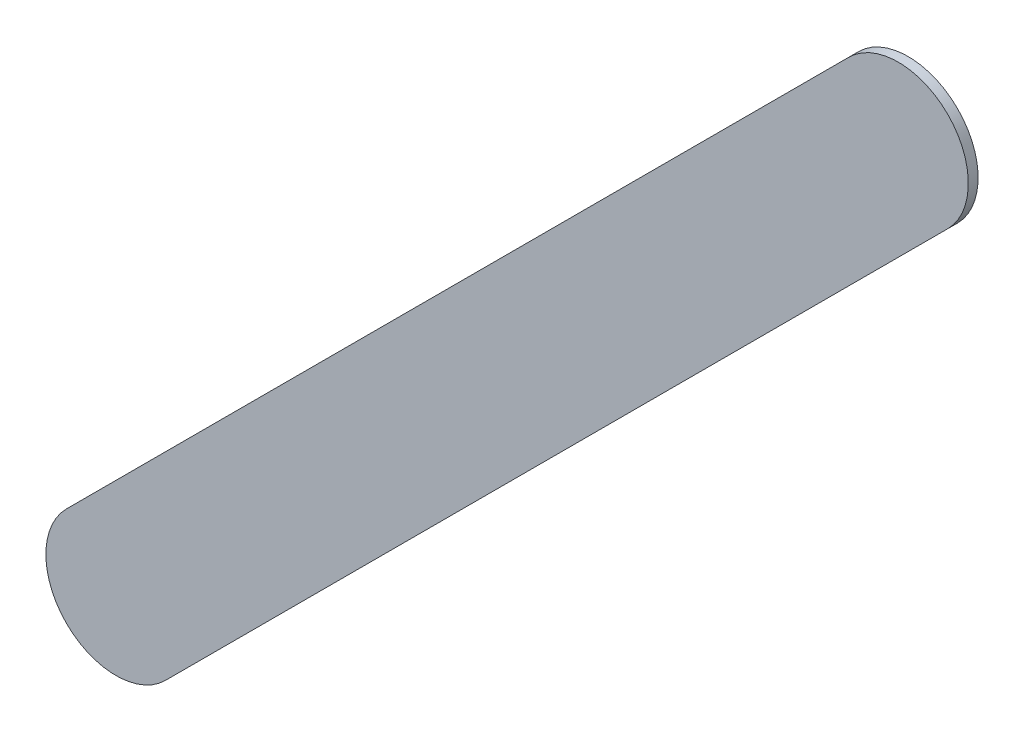
ISO-10303-21;
HEADER;
FILE_DESCRIPTION(('STEP AP214'),'2;1');
FILE_NAME('part.step','',(''),(''),'','','');
FILE_SCHEMA(('AUTOMOTIVE_DESIGN { 1 0 10303 214 1 1 1 1 }'));
ENDSEC;
DATA;
#1=APPLICATION_CONTEXT('core data for automotive mechanical design processes');
#2=APPLICATION_PROTOCOL_DEFINITION('international standard','automotive_design',2000,#1);
#3=PRODUCT_CONTEXT('',#1,'mechanical');
#4=PRODUCT('Part','Part','',(#3));
#5=PRODUCT_RELATED_PRODUCT_CATEGORY('part','',(#4));
#6=PRODUCT_DEFINITION_FORMATION('','',#4);
#7=PRODUCT_DEFINITION_CONTEXT('part definition',#1,'design');
#8=PRODUCT_DEFINITION('design','',#6,#7);
#9=PRODUCT_DEFINITION_SHAPE('','',#8);
#10=(LENGTH_UNIT() NAMED_UNIT(*) SI_UNIT(.MILLI.,.METRE.));
#11=(NAMED_UNIT(*) PLANE_ANGLE_UNIT() SI_UNIT($,.RADIAN.));
#12=(NAMED_UNIT(*) SI_UNIT($,.STERADIAN.) SOLID_ANGLE_UNIT());
#13=UNCERTAINTY_MEASURE_WITH_UNIT(LENGTH_MEASURE(1.E-05),#10,'distance_accuracy_value','');
#14=(GEOMETRIC_REPRESENTATION_CONTEXT(3) GLOBAL_UNCERTAINTY_ASSIGNED_CONTEXT((#13)) GLOBAL_UNIT_ASSIGNED_CONTEXT((#10,
#11,#12)) REPRESENTATION_CONTEXT('',''));
#15=CARTESIAN_POINT('',(0.,0.,0.));
#16=DIRECTION('',(0.,0.,1.));
#17=DIRECTION('',(1.,0.,0.));
#18=AXIS2_PLACEMENT_3D('',#15,#16,#17);
#19=CARTESIAN_POINT('',(139.622776,-108.380776,0.));
#20=DIRECTION('',(0.,0.,1.));
#21=DIRECTION('',(1.,0.,0.));
#22=AXIS2_PLACEMENT_3D('',#19,#20,#21);
#23=PLANE('',#22);
#24=DIRECTION('',(0.707106781186548,0.707106781186548,0.));
#25=VECTOR('',#24,1.);
#26=CARTESIAN_POINT('',(139.622776,-108.380776,0.));
#27=LINE('',#26,#25);
#28=CARTESIAN_POINT('',(139.622776,-108.380776,0.));
#29=VERTEX_POINT('',#28);
#30=CARTESIAN_POINT('',(142.416776,-105.586776,0.));
#31=VERTEX_POINT('',#30);
#32=EDGE_CURVE('E95',#29,#31,#27,.T.);
#33=ORIENTED_EDGE('',*,*,#32,.T.);
#34=CARTESIAN_POINT('',(142.2399995,-105.4099995,0.));
#35=DIRECTION('',(0.,0.,1.));
#36=DIRECTION('',(0.707106781186548,-0.707106781186548,0.));
#37=AXIS2_PLACEMENT_3D('',#34,#35,#36);
#38=CIRCLE('',#37,0.249999723809);
#39=CARTESIAN_POINT('',(142.063223,-105.233223,0.));
#40=VERTEX_POINT('',#39);
#41=EDGE_CURVE('E74',#31,#40,#38,.T.);
#42=ORIENTED_EDGE('',*,*,#41,.T.);
#43=DIRECTION('',(-0.707106781186548,-0.707106781186548,0.));
#44=VECTOR('',#43,1.);
#45=CARTESIAN_POINT('',(142.063223,-105.233223,0.));
#46=LINE('',#45,#44);
#47=CARTESIAN_POINT('',(139.269223,-108.027223,0.));
#48=VERTEX_POINT('',#47);
#49=EDGE_CURVE('E79',#40,#48,#46,.T.);
#50=ORIENTED_EDGE('',*,*,#49,.T.);
#51=CARTESIAN_POINT('',(139.4459995,-108.2039995,0.));
#52=DIRECTION('',(0.,0.,1.));
#53=DIRECTION('',(-0.707106781186548,0.707106781186548,0.));
#54=AXIS2_PLACEMENT_3D('',#51,#52,#53);
#55=CIRCLE('',#54,0.249999723809);
#56=EDGE_CURVE('E11',#48,#29,#55,.T.);
#57=ORIENTED_EDGE('',*,*,#56,.T.);
#58=EDGE_LOOP('',(#33,#42,#50,#57));
#59=FACE_BOUND('',#58,.T.);
#60=ADVANCED_FACE('F17',(#59),#23,.T.);
#61=CARTESIAN_POINT('',(139.622776,-108.380776,-0.035));
#62=DIRECTION('',(0.,0.,1.));
#63=DIRECTION('',(1.,0.,0.));
#64=AXIS2_PLACEMENT_3D('',#61,#62,#63);
#65=PLANE('',#64);
#66=CARTESIAN_POINT('',(139.4459995,-108.2039995,-0.035));
#67=DIRECTION('',(0.,0.,1.));
#68=DIRECTION('',(-0.707106781186548,0.707106781186548,0.));
#69=AXIS2_PLACEMENT_3D('',#66,#67,#68);
#70=CIRCLE('',#69,0.249999723809);
#71=CARTESIAN_POINT('',(139.269223,-108.027223,-0.035));
#72=VERTEX_POINT('',#71);
#73=CARTESIAN_POINT('',(139.622776,-108.380776,-0.035));
#74=VERTEX_POINT('',#73);
#75=EDGE_CURVE('E26',#72,#74,#70,.T.);
#76=ORIENTED_EDGE('',*,*,#75,.F.);
#77=DIRECTION('',(-0.707106781186548,-0.707106781186548,0.));
#78=VECTOR('',#77,1.);
#79=CARTESIAN_POINT('',(142.063223,-105.233223,-0.035));
#80=LINE('',#79,#78);
#81=CARTESIAN_POINT('',(142.063223,-105.233223,-0.035));
#82=VERTEX_POINT('',#81);
#83=EDGE_CURVE('E62',#82,#72,#80,.T.);
#84=ORIENTED_EDGE('',*,*,#83,.F.);
#85=CARTESIAN_POINT('',(142.2399995,-105.4099995,-0.035));
#86=DIRECTION('',(0.,0.,1.));
#87=DIRECTION('',(0.707106781186548,-0.707106781186548,0.));
#88=AXIS2_PLACEMENT_3D('',#85,#86,#87);
#89=CIRCLE('',#88,0.249999723809);
#90=CARTESIAN_POINT('',(142.416776,-105.586776,-0.035));
#91=VERTEX_POINT('',#90);
#92=EDGE_CURVE('E67',#91,#82,#89,.T.);
#93=ORIENTED_EDGE('',*,*,#92,.F.);
#94=DIRECTION('',(0.707106781186548,0.707106781186548,0.));
#95=VECTOR('',#94,1.);
#96=CARTESIAN_POINT('',(139.622776,-108.380776,-0.035));
#97=LINE('',#96,#95);
#98=EDGE_CURVE('E113',#74,#91,#97,.T.);
#99=ORIENTED_EDGE('',*,*,#98,.F.);
#100=EDGE_LOOP('',(#76,#84,#93,#99));
#101=FACE_BOUND('',#100,.T.);
#102=ADVANCED_FACE('F64',(#101),#65,.F.);
#103=CARTESIAN_POINT('',(139.4459995,-108.2039995,-0.035));
#104=DIRECTION('',(0.,0.,-1.));
#105=DIRECTION('',(-0.707106781186548,0.707106781186548,0.));
#106=AXIS2_PLACEMENT_3D('',#103,#104,#105);
#107=CYLINDRICAL_SURFACE('',#106,0.249999723809);
#108=ORIENTED_EDGE('',*,*,#75,.T.);
#109=DIRECTION('',(0.,0.,1.));
#110=VECTOR('',#109,1.);
#111=CARTESIAN_POINT('',(139.622776,-108.380776,-0.035));
#112=LINE('',#111,#110);
#113=EDGE_CURVE('E89',#74,#29,#112,.T.);
#114=ORIENTED_EDGE('',*,*,#113,.T.);
#115=ORIENTED_EDGE('',*,*,#56,.F.);
#116=DIRECTION('',(0.,0.,1.));
#117=VECTOR('',#116,1.);
#118=CARTESIAN_POINT('',(139.269223,-108.027223,-0.035));
#119=LINE('',#118,#117);
#120=EDGE_CURVE('E73',#72,#48,#119,.T.);
#121=ORIENTED_EDGE('',*,*,#120,.F.);
#122=EDGE_LOOP('',(#108,#114,#115,#121));
#123=FACE_BOUND('',#122,.T.);
#124=ADVANCED_FACE('F173',(#123),#107,.T.);
#125=CARTESIAN_POINT('',(142.063223,-105.233223,-0.035));
#126=DIRECTION('',(0.707106781186548,-0.707106781186548,0.));
#127=DIRECTION('',(0.,0.,-1.));
#128=AXIS2_PLACEMENT_3D('',#125,#126,#127);
#129=PLANE('',#128);
#130=ORIENTED_EDGE('',*,*,#83,.T.);
#131=ORIENTED_EDGE('',*,*,#120,.T.);
#132=ORIENTED_EDGE('',*,*,#49,.F.);
#133=DIRECTION('',(0.,0.,1.));
#134=VECTOR('',#133,1.);
#135=CARTESIAN_POINT('',(142.063223,-105.233223,-0.035));
#136=LINE('',#135,#134);
#137=EDGE_CURVE('E77',#82,#40,#136,.T.);
#138=ORIENTED_EDGE('',*,*,#137,.F.);
#139=EDGE_LOOP('',(#130,#131,#132,#138));
#140=FACE_BOUND('',#139,.T.);
#141=ADVANCED_FACE('F78',(#140),#129,.F.);
#142=CARTESIAN_POINT('',(142.2399995,-105.4099995,-0.035));
#143=DIRECTION('',(0.,0.,-1.));
#144=DIRECTION('',(0.707106781186548,-0.707106781186548,0.));
#145=AXIS2_PLACEMENT_3D('',#142,#143,#144);
#146=CYLINDRICAL_SURFACE('',#145,0.249999723809);
#147=ORIENTED_EDGE('',*,*,#92,.T.);
#148=ORIENTED_EDGE('',*,*,#137,.T.);
#149=ORIENTED_EDGE('',*,*,#41,.F.);
#150=DIRECTION('',(0.,0.,1.));
#151=VECTOR('',#150,1.);
#152=CARTESIAN_POINT('',(142.416776,-105.586776,-0.035));
#153=LINE('',#152,#151);
#154=EDGE_CURVE('E86',#91,#31,#153,.T.);
#155=ORIENTED_EDGE('',*,*,#154,.F.);
#156=EDGE_LOOP('',(#147,#148,#149,#155));
#157=FACE_BOUND('',#156,.T.);
#158=ADVANCED_FACE('F84',(#157),#146,.T.);
#159=CARTESIAN_POINT('',(139.622776,-108.380776,-0.035));
#160=DIRECTION('',(-0.707106781186548,0.707106781186548,0.));
#161=DIRECTION('',(0.,0.,1.));
#162=AXIS2_PLACEMENT_3D('',#159,#160,#161);
#163=PLANE('',#162);
#164=ORIENTED_EDGE('',*,*,#98,.T.);
#165=ORIENTED_EDGE('',*,*,#154,.T.);
#166=ORIENTED_EDGE('',*,*,#32,.F.);
#167=ORIENTED_EDGE('',*,*,#113,.F.);
#168=EDGE_LOOP('',(#164,#165,#166,#167));
#169=FACE_BOUND('',#168,.T.);
#170=ADVANCED_FACE('F121',(#169),#163,.F.);
#171=CLOSED_SHELL('',(#60,#102,#124,#141,#158,#170));
#172=MANIFOLD_SOLID_BREP('B1',#171);
#173=ADVANCED_BREP_SHAPE_REPRESENTATION('',(#18,#172),#14);
#174=SHAPE_DEFINITION_REPRESENTATION(#9,#173);
ENDSEC;
END-ISO-10303-21;
